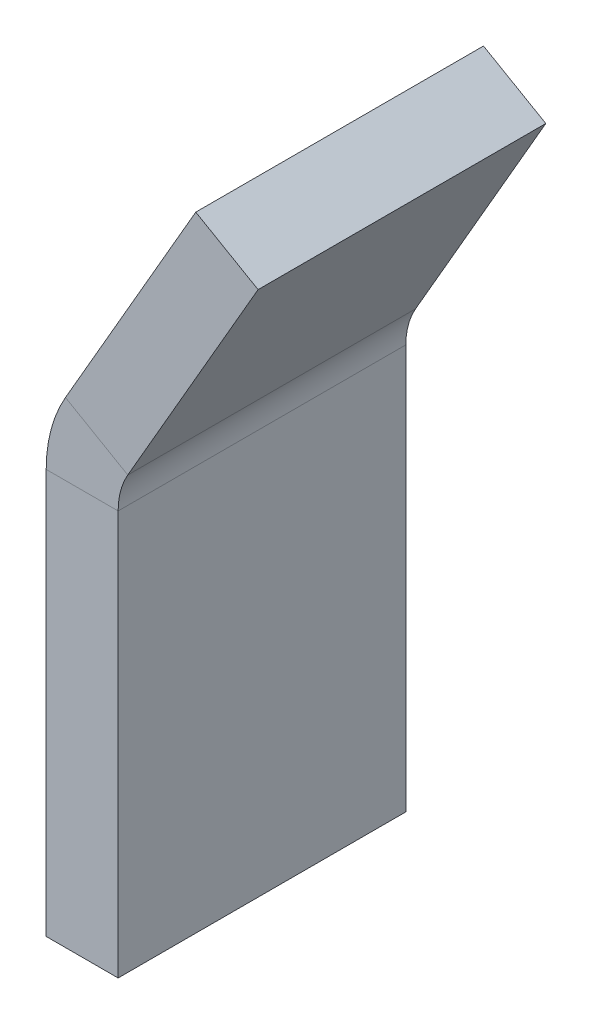
ISO-10303-21;
HEADER;
FILE_DESCRIPTION(('STEP AP214'),'2;1');
FILE_NAME('part.step','',(''),(''),'','','');
FILE_SCHEMA(('AUTOMOTIVE_DESIGN { 1 0 10303 214 1 1 1 1 }'));
ENDSEC;
DATA;
#1=APPLICATION_CONTEXT('core data for automotive mechanical design processes');
#2=APPLICATION_PROTOCOL_DEFINITION('international standard','automotive_design',2000,#1);
#3=PRODUCT_CONTEXT('',#1,'mechanical');
#4=PRODUCT('Part','Part','',(#3));
#5=PRODUCT_RELATED_PRODUCT_CATEGORY('part','',(#4));
#6=PRODUCT_DEFINITION_FORMATION('','',#4);
#7=PRODUCT_DEFINITION_CONTEXT('part definition',#1,'design');
#8=PRODUCT_DEFINITION('design','',#6,#7);
#9=PRODUCT_DEFINITION_SHAPE('','',#8);
#10=(LENGTH_UNIT() NAMED_UNIT(*) SI_UNIT(.MILLI.,.METRE.));
#11=(NAMED_UNIT(*) PLANE_ANGLE_UNIT() SI_UNIT($,.RADIAN.));
#12=(NAMED_UNIT(*) SI_UNIT($,.STERADIAN.) SOLID_ANGLE_UNIT());
#13=UNCERTAINTY_MEASURE_WITH_UNIT(LENGTH_MEASURE(1.E-05),#10,'distance_accuracy_value','');
#14=(GEOMETRIC_REPRESENTATION_CONTEXT(3) GLOBAL_UNCERTAINTY_ASSIGNED_CONTEXT((#13)) GLOBAL_UNIT_ASSIGNED_CONTEXT((#10,
#11,#12)) REPRESENTATION_CONTEXT('',''));
#15=CARTESIAN_POINT('',(0.,0.,0.));
#16=DIRECTION('',(0.,0.,1.));
#17=DIRECTION('',(1.,0.,0.));
#18=AXIS2_PLACEMENT_3D('',#15,#16,#17);
#19=CARTESIAN_POINT('',(-19.3962081150489,3.81236584045779,-25.4));
#20=DIRECTION('',(0.866025403784438,-0.500000000000001,0.));
#21=DIRECTION('',(0.,0.,-1.));
#22=AXIS2_PLACEMENT_3D('',#19,#20,#21);
#23=PLANE('',#22);
#24=DIRECTION('',(0.500000000000001,0.866025403784438,0.));
#25=VECTOR('',#24,1.);
#26=CARTESIAN_POINT('',(-19.3962081150489,3.81236584045778,0.));
#27=LINE('',#26,#25);
#28=CARTESIAN_POINT('',(0.85073868596882,38.8811063979646,0.));
#29=VERTEX_POINT('',#28);
#30=CARTESIAN_POINT('',(12.3537918849511,58.8049789807696,0.));
#31=VERTEX_POINT('',#30);
#32=EDGE_CURVE('E84',#29,#31,#27,.T.);
#33=ORIENTED_EDGE('',*,*,#32,.F.);
#34=DIRECTION('',(0.,0.,-1.));
#35=VECTOR('',#34,1.);
#36=CARTESIAN_POINT('',(0.85073868596882,38.8811063979646,-25.4));
#37=LINE('',#36,#35);
#38=CARTESIAN_POINT('',(0.850738685968817,38.8811063979646,-25.4));
#39=VERTEX_POINT('',#38);
#40=EDGE_CURVE('E76',#29,#39,#37,.T.);
#41=ORIENTED_EDGE('',*,*,#40,.T.);
#42=DIRECTION('',(0.500000000000001,0.866025403784438,0.));
#43=VECTOR('',#42,1.);
#44=CARTESIAN_POINT('',(-19.3962081150489,3.81236584045779,-25.4));
#45=LINE('',#44,#43);
#46=CARTESIAN_POINT('',(12.3537918849511,58.8049789807696,-25.4));
#47=VERTEX_POINT('',#46);
#48=EDGE_CURVE('E92',#39,#47,#45,.T.);
#49=ORIENTED_EDGE('',*,*,#48,.T.);
#50=DIRECTION('',(0.,0.,1.));
#51=VECTOR('',#50,1.);
#52=CARTESIAN_POINT('',(12.3537918849511,58.8049789807696,-25.4));
#53=LINE('',#52,#51);
#54=EDGE_CURVE('E150',#47,#31,#53,.T.);
#55=ORIENTED_EDGE('',*,*,#54,.T.);
#56=EDGE_LOOP('',(#33,#41,#49,#55));
#57=FACE_BOUND('',#56,.T.);
#58=ADVANCED_FACE('F67',(#57),#23,.T.);
#59=CARTESIAN_POINT('',(12.3537918849511,58.8049789807696,-25.4));
#60=DIRECTION('',(0.,0.,-1.));
#61=DIRECTION('',(-0.866025403784438,0.500000000000001,0.));
#62=AXIS2_PLACEMENT_3D('',#59,#60,#61);
#63=PLANE('',#62);
#64=ORIENTED_EDGE('',*,*,#48,.F.);
#65=DIRECTION('',(-0.866025403784438,0.500000000000001,0.));
#66=VECTOR('',#65,1.);
#67=CARTESIAN_POINT('',(0.85073868596882,38.8811063979646,-25.4));
#68=LINE('',#67,#66);
#69=CARTESIAN_POINT('',(-4.64852262806237,42.0561063979646,-25.4));
#70=VERTEX_POINT('',#69);
#71=EDGE_CURVE('E132',#39,#70,#68,.T.);
#72=ORIENTED_EDGE('',*,*,#71,.T.);
#73=DIRECTION('',(0.500000000000001,0.866025403784438,0.));
#74=VECTOR('',#73,1.);
#75=CARTESIAN_POINT('',(-24.8954694290801,6.98736584045779,-25.4));
#76=LINE('',#75,#74);
#77=CARTESIAN_POINT('',(6.85453057091994,61.9799789807696,-25.4));
#78=VERTEX_POINT('',#77);
#79=EDGE_CURVE('E135',#70,#78,#76,.T.);
#80=ORIENTED_EDGE('',*,*,#79,.T.);
#81=DIRECTION('',(0.866025403784438,-0.500000000000001,0.));
#82=VECTOR('',#81,1.);
#83=CARTESIAN_POINT('',(6.85453057091994,61.9799789807696,-25.4));
#84=LINE('',#83,#82);
#85=EDGE_CURVE('E151',#78,#47,#84,.T.);
#86=ORIENTED_EDGE('',*,*,#85,.T.);
#87=EDGE_LOOP('',(#64,#72,#80,#86));
#88=FACE_BOUND('',#87,.T.);
#89=ADVANCED_FACE('F134',(#88),#63,.T.);
#90=CARTESIAN_POINT('',(-24.8954694290801,6.98736584045779,-25.4));
#91=DIRECTION('',(0.866025403784438,-0.500000000000001,0.));
#92=DIRECTION('',(0.,0.,-1.));
#93=AXIS2_PLACEMENT_3D('',#90,#91,#92);
#94=PLANE('',#93);
#95=DIRECTION('',(0.,0.,-1.));
#96=VECTOR('',#95,1.);
#97=CARTESIAN_POINT('',(-4.64852262806236,42.0561063979646,-25.4));
#98=LINE('',#97,#96);
#99=CARTESIAN_POINT('',(-4.64852262806236,42.0561063979646,0.));
#100=VERTEX_POINT('',#99);
#101=EDGE_CURVE('E141',#100,#70,#98,.T.);
#102=ORIENTED_EDGE('',*,*,#101,.F.);
#103=DIRECTION('',(0.500000000000001,0.866025403784438,0.));
#104=VECTOR('',#103,1.);
#105=CARTESIAN_POINT('',(-24.8954694290801,6.98736584045779,0.));
#106=LINE('',#105,#104);
#107=CARTESIAN_POINT('',(6.85453057091995,61.9799789807696,0.));
#108=VERTEX_POINT('',#107);
#109=EDGE_CURVE('E71',#100,#108,#106,.T.);
#110=ORIENTED_EDGE('',*,*,#109,.T.);
#111=DIRECTION('',(0.,0.,1.));
#112=VECTOR('',#111,1.);
#113=CARTESIAN_POINT('',(6.85453057091994,61.9799789807696,-25.4));
#114=LINE('',#113,#112);
#115=EDGE_CURVE('E148',#78,#108,#114,.T.);
#116=ORIENTED_EDGE('',*,*,#115,.F.);
#117=ORIENTED_EDGE('',*,*,#79,.F.);
#118=EDGE_LOOP('',(#102,#110,#116,#117));
#119=FACE_BOUND('',#118,.T.);
#120=ADVANCED_FACE('F145',(#119),#94,.F.);
#121=CARTESIAN_POINT('',(6.85453057091994,61.9799789807696,-25.4));
#122=DIRECTION('',(-0.500000000000001,-0.866025403784438,0.));
#123=DIRECTION('',(0.,0.,-1.));
#124=AXIS2_PLACEMENT_3D('',#121,#122,#123);
#125=PLANE('',#124);
#126=DIRECTION('',(0.866025403784438,-0.500000000000001,0.));
#127=VECTOR('',#126,1.);
#128=CARTESIAN_POINT('',(6.85453057091995,61.9799789807696,0.));
#129=LINE('',#128,#127);
#130=EDGE_CURVE('E201',#108,#31,#129,.T.);
#131=ORIENTED_EDGE('',*,*,#130,.T.);
#132=ORIENTED_EDGE('',*,*,#54,.F.);
#133=ORIENTED_EDGE('',*,*,#85,.F.);
#134=ORIENTED_EDGE('',*,*,#115,.T.);
#135=EDGE_LOOP('',(#131,#132,#133,#134));
#136=FACE_BOUND('',#135,.T.);
#137=ADVANCED_FACE('F211',(#136),#125,.F.);
#138=CARTESIAN_POINT('',(12.3537918849511,58.8049789807696,0.));
#139=DIRECTION('',(0.,0.,-1.));
#140=DIRECTION('',(-0.866025403784438,0.500000000000001,0.));
#141=AXIS2_PLACEMENT_3D('',#138,#139,#140);
#142=PLANE('',#141);
#143=DIRECTION('',(-0.866025403784438,0.500000000000001,0.));
#144=VECTOR('',#143,1.);
#145=CARTESIAN_POINT('',(0.85073868596882,38.8811063979646,0.));
#146=LINE('',#145,#144);
#147=EDGE_CURVE('E12',#29,#100,#146,.T.);
#148=ORIENTED_EDGE('',*,*,#147,.F.);
#149=ORIENTED_EDGE('',*,*,#32,.T.);
#150=ORIENTED_EDGE('',*,*,#130,.F.);
#151=ORIENTED_EDGE('',*,*,#109,.F.);
#152=EDGE_LOOP('',(#148,#149,#150,#151));
#153=FACE_BOUND('',#152,.T.);
#154=ADVANCED_FACE('F69',(#153),#142,.F.);
#155=CARTESIAN_POINT('',(0.,0.,-25.4));
#156=DIRECTION('',(0.,1.,0.));
#157=DIRECTION('',(0.,0.,1.));
#158=AXIS2_PLACEMENT_3D('',#155,#156,#157);
#159=PLANE('',#158);
#160=DIRECTION('',(-1.,0.,0.));
#161=VECTOR('',#160,1.);
#162=CARTESIAN_POINT('',(0.,0.,0.));
#163=LINE('',#162,#161);
#164=CARTESIAN_POINT('',(0.,0.,0.));
#165=VERTEX_POINT('',#164);
#166=CARTESIAN_POINT('',(-6.35,0.,0.));
#167=VERTEX_POINT('',#166);
#168=EDGE_CURVE('E197',#165,#167,#163,.T.);
#169=ORIENTED_EDGE('',*,*,#168,.T.);
#170=DIRECTION('',(0.,0.,1.));
#171=VECTOR('',#170,1.);
#172=CARTESIAN_POINT('',(-6.35,0.,-25.4));
#173=LINE('',#172,#171);
#174=CARTESIAN_POINT('',(-6.35,0.,-25.4));
#175=VERTEX_POINT('',#174);
#176=EDGE_CURVE('E187',#175,#167,#173,.T.);
#177=ORIENTED_EDGE('',*,*,#176,.F.);
#178=DIRECTION('',(-1.,0.,0.));
#179=VECTOR('',#178,1.);
#180=CARTESIAN_POINT('',(0.,0.,-25.4));
#181=LINE('',#180,#179);
#182=CARTESIAN_POINT('',(0.,0.,-25.4));
#183=VERTEX_POINT('',#182);
#184=EDGE_CURVE('E185',#183,#175,#181,.T.);
#185=ORIENTED_EDGE('',*,*,#184,.F.);
#186=DIRECTION('',(0.,0.,1.));
#187=VECTOR('',#186,1.);
#188=CARTESIAN_POINT('',(0.,0.,-25.4));
#189=LINE('',#188,#187);
#190=EDGE_CURVE('E195',#183,#165,#189,.T.);
#191=ORIENTED_EDGE('',*,*,#190,.T.);
#192=EDGE_LOOP('',(#169,#177,#185,#191));
#193=FACE_BOUND('',#192,.T.);
#194=ADVANCED_FACE('F240',(#193),#159,.F.);
#195=CARTESIAN_POINT('',(-6.35,0.,-25.4));
#196=DIRECTION('',(1.,0.,0.));
#197=DIRECTION('',(0.,0.,-1.));
#198=AXIS2_PLACEMENT_3D('',#195,#196,#197);
#199=PLANE('',#198);
#200=DIRECTION('',(0.,1.,0.));
#201=VECTOR('',#200,1.);
#202=CARTESIAN_POINT('',(-6.35,0.,0.));
#203=LINE('',#202,#201);
#204=CARTESIAN_POINT('',(-6.35,35.7061063979646,0.));
#205=VERTEX_POINT('',#204);
#206=EDGE_CURVE('E193',#167,#205,#203,.T.);
#207=ORIENTED_EDGE('',*,*,#206,.T.);
#208=DIRECTION('',(0.,0.,-1.));
#209=VECTOR('',#208,1.);
#210=CARTESIAN_POINT('',(-6.35,35.7061063979646,-25.4));
#211=LINE('',#210,#209);
#212=CARTESIAN_POINT('',(-6.35,35.7061063979646,-25.4));
#213=VERTEX_POINT('',#212);
#214=EDGE_CURVE('E190',#205,#213,#211,.T.);
#215=ORIENTED_EDGE('',*,*,#214,.T.);
#216=DIRECTION('',(0.,1.,0.));
#217=VECTOR('',#216,1.);
#218=CARTESIAN_POINT('',(-6.35,0.,-25.4));
#219=LINE('',#218,#217);
#220=EDGE_CURVE('E183',#175,#213,#219,.T.);
#221=ORIENTED_EDGE('',*,*,#220,.F.);
#222=ORIENTED_EDGE('',*,*,#176,.T.);
#223=EDGE_LOOP('',(#207,#215,#221,#222));
#224=FACE_BOUND('',#223,.T.);
#225=ADVANCED_FACE('F236',(#224),#199,.F.);
#226=CARTESIAN_POINT('',(0.,63.5,-25.4));
#227=DIRECTION('',(0.,0.,-1.));
#228=DIRECTION('',(-1.,0.,0.));
#229=AXIS2_PLACEMENT_3D('',#226,#227,#228);
#230=PLANE('',#229);
#231=DIRECTION('',(-1.,0.,0.));
#232=VECTOR('',#231,1.);
#233=CARTESIAN_POINT('',(0.,35.7061063979646,-25.4));
#234=LINE('',#233,#232);
#235=CARTESIAN_POINT('',(0.,35.7061063979646,-25.4));
#236=VERTEX_POINT('',#235);
#237=EDGE_CURVE('E164',#236,#213,#234,.T.);
#238=ORIENTED_EDGE('',*,*,#237,.F.);
#239=DIRECTION('',(0.,1.,0.));
#240=VECTOR('',#239,1.);
#241=CARTESIAN_POINT('',(0.,0.,-25.4));
#242=LINE('',#241,#240);
#243=EDGE_CURVE('E181',#183,#236,#242,.T.);
#244=ORIENTED_EDGE('',*,*,#243,.F.);
#245=ORIENTED_EDGE('',*,*,#184,.T.);
#246=ORIENTED_EDGE('',*,*,#220,.T.);
#247=EDGE_LOOP('',(#238,#244,#245,#246));
#248=FACE_BOUND('',#247,.T.);
#249=ADVANCED_FACE('F232',(#248),#230,.T.);
#250=CARTESIAN_POINT('',(0.,0.,-25.4));
#251=DIRECTION('',(1.,0.,0.));
#252=DIRECTION('',(0.,0.,-1.));
#253=AXIS2_PLACEMENT_3D('',#250,#251,#252);
#254=PLANE('',#253);
#255=DIRECTION('',(0.,0.,-1.));
#256=VECTOR('',#255,1.);
#257=CARTESIAN_POINT('',(0.,35.7061063979646,-25.4));
#258=LINE('',#257,#256);
#259=CARTESIAN_POINT('',(0.,35.7061063979646,0.));
#260=VERTEX_POINT('',#259);
#261=EDGE_CURVE('E165',#260,#236,#258,.T.);
#262=ORIENTED_EDGE('',*,*,#261,.F.);
#263=DIRECTION('',(0.,1.,0.));
#264=VECTOR('',#263,1.);
#265=CARTESIAN_POINT('',(0.,0.,0.));
#266=LINE('',#265,#264);
#267=EDGE_CURVE('E179',#165,#260,#266,.T.);
#268=ORIENTED_EDGE('',*,*,#267,.F.);
#269=ORIENTED_EDGE('',*,*,#190,.F.);
#270=ORIENTED_EDGE('',*,*,#243,.T.);
#271=EDGE_LOOP('',(#262,#268,#269,#270));
#272=FACE_BOUND('',#271,.T.);
#273=ADVANCED_FACE('F228',(#272),#254,.T.);
#274=CARTESIAN_POINT('',(0.,63.5,0.));
#275=DIRECTION('',(0.,0.,-1.));
#276=DIRECTION('',(-1.,0.,0.));
#277=AXIS2_PLACEMENT_3D('',#274,#275,#276);
#278=PLANE('',#277);
#279=ORIENTED_EDGE('',*,*,#267,.T.);
#280=DIRECTION('',(-1.,0.,0.));
#281=VECTOR('',#280,1.);
#282=CARTESIAN_POINT('',(0.,35.7061063979646,0.));
#283=LINE('',#282,#281);
#284=EDGE_CURVE('E176',#260,#205,#283,.T.);
#285=ORIENTED_EDGE('',*,*,#284,.T.);
#286=ORIENTED_EDGE('',*,*,#206,.F.);
#287=ORIENTED_EDGE('',*,*,#168,.F.);
#288=EDGE_LOOP('',(#279,#285,#286,#287));
#289=FACE_BOUND('',#288,.T.);
#290=ADVANCED_FACE('F224',(#289),#278,.F.);
#291=CARTESIAN_POINT('',(6.35,35.7061063979646,0.));
#292=DIRECTION('',(0.,0.,1.));
#293=DIRECTION('',(0.,-1.,0.));
#294=AXIS2_PLACEMENT_3D('',#291,#292,#293);
#295=PLANE('',#294);
#296=ORIENTED_EDGE('',*,*,#284,.F.);
#297=CARTESIAN_POINT('',(6.35,35.7061063979646,0.));
#298=DIRECTION('',(0.,0.,-1.));
#299=DIRECTION('',(0.,1.,0.));
#300=AXIS2_PLACEMENT_3D('',#297,#298,#299);
#301=CIRCLE('',#300,6.35);
#302=EDGE_CURVE('E173',#260,#29,#301,.T.);
#303=ORIENTED_EDGE('',*,*,#302,.T.);
#304=ORIENTED_EDGE('',*,*,#147,.T.);
#305=CARTESIAN_POINT('',(6.35,35.7061063979646,0.));
#306=DIRECTION('',(0.,0.,-1.));
#307=DIRECTION('',(0.,1.,0.));
#308=AXIS2_PLACEMENT_3D('',#305,#306,#307);
#309=CIRCLE('',#308,12.7);
#310=EDGE_CURVE('E159',#205,#100,#309,.T.);
#311=ORIENTED_EDGE('',*,*,#310,.F.);
#312=EDGE_LOOP('',(#296,#303,#304,#311));
#313=FACE_BOUND('',#312,.T.);
#314=ADVANCED_FACE('F227',(#313),#295,.T.);
#315=CARTESIAN_POINT('',(6.35,35.7061063979646,-25.4));
#316=DIRECTION('',(0.,0.,-1.));
#317=DIRECTION('',(-1.,0.,0.));
#318=AXIS2_PLACEMENT_3D('',#315,#316,#317);
#319=PLANE('',#318);
#320=ORIENTED_EDGE('',*,*,#71,.F.);
#321=CARTESIAN_POINT('',(6.35,35.7061063979646,-25.4));
#322=DIRECTION('',(0.,0.,-1.));
#323=DIRECTION('',(0.,1.,0.));
#324=AXIS2_PLACEMENT_3D('',#321,#322,#323);
#325=CIRCLE('',#324,6.35);
#326=EDGE_CURVE('E169',#39,#236,#325,.F.);
#327=ORIENTED_EDGE('',*,*,#326,.T.);
#328=ORIENTED_EDGE('',*,*,#237,.T.);
#329=CARTESIAN_POINT('',(6.35,35.7061063979646,-25.4));
#330=DIRECTION('',(0.,0.,1.));
#331=DIRECTION('',(-1.,0.,0.));
#332=AXIS2_PLACEMENT_3D('',#329,#330,#331);
#333=CIRCLE('',#332,12.7);
#334=EDGE_CURVE('E157',#70,#213,#333,.T.);
#335=ORIENTED_EDGE('',*,*,#334,.F.);
#336=EDGE_LOOP('',(#320,#327,#328,#335));
#337=FACE_BOUND('',#336,.T.);
#338=ADVANCED_FACE('F162',(#337),#319,.T.);
#339=CARTESIAN_POINT('',(6.35,35.7061063979646,13.9158863521669));
#340=DIRECTION('',(0.,0.,-1.));
#341=DIRECTION('',(0.,1.,0.));
#342=AXIS2_PLACEMENT_3D('',#339,#340,#341);
#343=CYLINDRICAL_SURFACE('',#342,12.7);
#344=ORIENTED_EDGE('',*,*,#334,.T.);
#345=ORIENTED_EDGE('',*,*,#214,.F.);
#346=ORIENTED_EDGE('',*,*,#310,.T.);
#347=ORIENTED_EDGE('',*,*,#101,.T.);
#348=EDGE_LOOP('',(#344,#345,#346,#347));
#349=FACE_BOUND('',#348,.T.);
#350=ADVANCED_FACE('F155',(#349),#343,.T.);
#351=CARTESIAN_POINT('',(6.35,35.7061063979646,13.9158863521669));
#352=DIRECTION('',(0.,0.,-1.));
#353=DIRECTION('',(0.,1.,0.));
#354=AXIS2_PLACEMENT_3D('',#351,#352,#353);
#355=CYLINDRICAL_SURFACE('',#354,6.35);
#356=ORIENTED_EDGE('',*,*,#326,.F.);
#357=ORIENTED_EDGE('',*,*,#40,.F.);
#358=ORIENTED_EDGE('',*,*,#302,.F.);
#359=ORIENTED_EDGE('',*,*,#261,.T.);
#360=EDGE_LOOP('',(#356,#357,#358,#359));
#361=FACE_BOUND('',#360,.T.);
#362=ADVANCED_FACE('F250',(#361),#355,.F.);
#363=CLOSED_SHELL('',(#58,#89,#120,#137,#154,#194,#225,#249,#273,#290,#314,#338,#350,#362));
#364=MANIFOLD_SOLID_BREP('B2',#363);
#365=ADVANCED_BREP_SHAPE_REPRESENTATION('',(#18,#364),#14);
#366=SHAPE_DEFINITION_REPRESENTATION(#9,#365);
ENDSEC;
END-ISO-10303-21;
